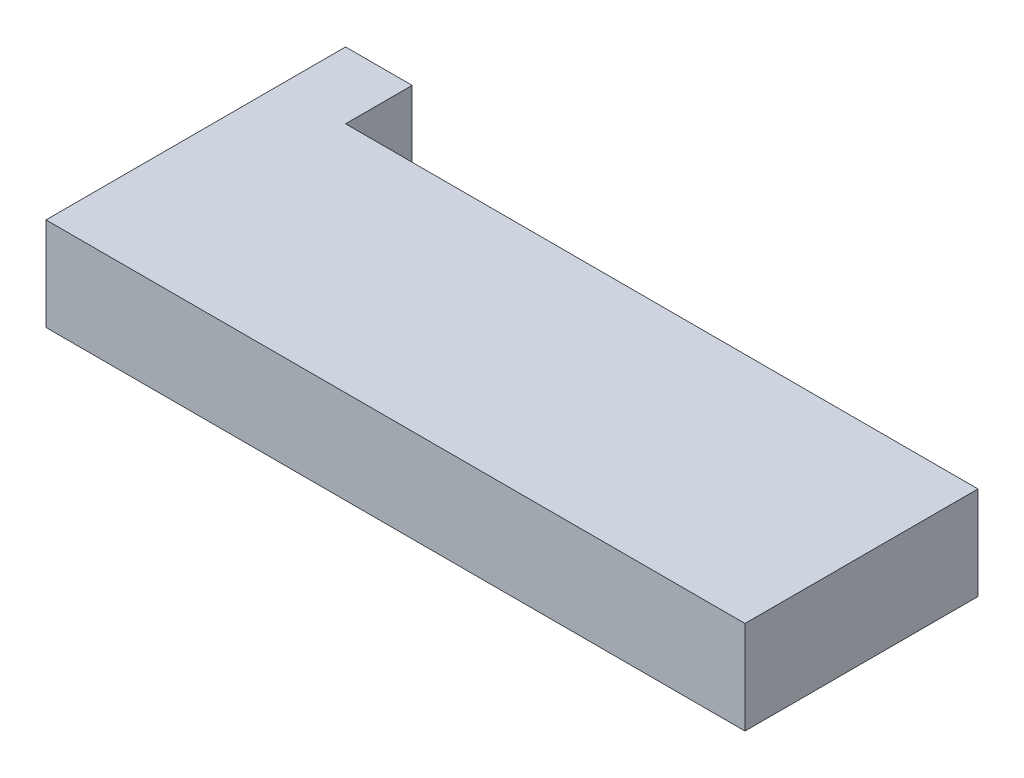
ISO-10303-21;
HEADER;
FILE_DESCRIPTION(('STEP AP214'),'2;1');
FILE_NAME('part.step','',(''),(''),'','','');
FILE_SCHEMA(('AUTOMOTIVE_DESIGN { 1 0 10303 214 1 1 1 1 }'));
ENDSEC;
DATA;
#1=APPLICATION_CONTEXT('core data for automotive mechanical design processes');
#2=APPLICATION_PROTOCOL_DEFINITION('international standard','automotive_design',2000,#1);
#3=PRODUCT_CONTEXT('',#1,'mechanical');
#4=PRODUCT('Part','Part','',(#3));
#5=PRODUCT_RELATED_PRODUCT_CATEGORY('part','',(#4));
#6=PRODUCT_DEFINITION_FORMATION('','',#4);
#7=PRODUCT_DEFINITION_CONTEXT('part definition',#1,'design');
#8=PRODUCT_DEFINITION('design','',#6,#7);
#9=PRODUCT_DEFINITION_SHAPE('','',#8);
#10=(LENGTH_UNIT() NAMED_UNIT(*) SI_UNIT(.MILLI.,.METRE.));
#11=(NAMED_UNIT(*) PLANE_ANGLE_UNIT() SI_UNIT($,.RADIAN.));
#12=(NAMED_UNIT(*) SI_UNIT($,.STERADIAN.) SOLID_ANGLE_UNIT());
#13=UNCERTAINTY_MEASURE_WITH_UNIT(LENGTH_MEASURE(1.E-05),#10,'distance_accuracy_value','');
#14=(GEOMETRIC_REPRESENTATION_CONTEXT(3) GLOBAL_UNCERTAINTY_ASSIGNED_CONTEXT((#13)) GLOBAL_UNIT_ASSIGNED_CONTEXT((#10,
#11,#12)) REPRESENTATION_CONTEXT('',''));
#15=CARTESIAN_POINT('',(0.,0.,0.));
#16=DIRECTION('',(0.,0.,1.));
#17=DIRECTION('',(1.,0.,0.));
#18=AXIS2_PLACEMENT_3D('',#15,#16,#17);
#19=CARTESIAN_POINT('',(-52.5,14.,-17.5));
#20=DIRECTION('',(0.,0.,1.));
#21=DIRECTION('',(1.,0.,0.));
#22=AXIS2_PLACEMENT_3D('',#19,#20,#21);
#23=PLANE('',#22);
#24=DIRECTION('',(0.,-1.,0.));
#25=VECTOR('',#24,1.);
#26=CARTESIAN_POINT('',(-42.5,14.,-17.5));
#27=LINE('',#26,#25);
#28=CARTESIAN_POINT('',(-42.5,14.,-17.5));
#29=VERTEX_POINT('',#28);
#30=CARTESIAN_POINT('',(-42.5,0.,-17.5));
#31=VERTEX_POINT('',#30);
#32=EDGE_CURVE('E53',#29,#31,#27,.T.);
#33=ORIENTED_EDGE('',*,*,#32,.F.);
#34=DIRECTION('',(-1.,0.,0.));
#35=VECTOR('',#34,1.);
#36=CARTESIAN_POINT('',(-52.5,14.,-17.5));
#37=LINE('',#36,#35);
#38=CARTESIAN_POINT('',(52.5,14.,-17.5));
#39=VERTEX_POINT('',#38);
#40=EDGE_CURVE('E133',#39,#29,#37,.T.);
#41=ORIENTED_EDGE('',*,*,#40,.F.);
#42=DIRECTION('',(0.,-1.,0.));
#43=VECTOR('',#42,1.);
#44=CARTESIAN_POINT('',(52.5,14.,-17.5));
#45=LINE('',#44,#43);
#46=CARTESIAN_POINT('',(52.5,0.,-17.5));
#47=VERTEX_POINT('',#46);
#48=EDGE_CURVE('E135',#39,#47,#45,.T.);
#49=ORIENTED_EDGE('',*,*,#48,.T.);
#50=DIRECTION('',(-1.,0.,0.));
#51=VECTOR('',#50,1.);
#52=CARTESIAN_POINT('',(-52.5,0.,-17.5));
#53=LINE('',#52,#51);
#54=EDGE_CURVE('E106',#47,#31,#53,.T.);
#55=ORIENTED_EDGE('',*,*,#54,.T.);
#56=EDGE_LOOP('',(#33,#41,#49,#55));
#57=FACE_BOUND('',#56,.T.);
#58=ADVANCED_FACE('F38',(#57),#23,.F.);
#59=CARTESIAN_POINT('',(-52.5,14.,-17.5));
#60=DIRECTION('',(1.,0.,0.));
#61=DIRECTION('',(0.,0.,-1.));
#62=AXIS2_PLACEMENT_3D('',#59,#60,#61);
#63=PLANE('',#62);
#64=DIRECTION('',(0.,0.,1.));
#65=VECTOR('',#64,1.);
#66=CARTESIAN_POINT('',(-52.5,0.,-17.5));
#67=LINE('',#66,#65);
#68=CARTESIAN_POINT('',(-52.5,0.,-27.5));
#69=VERTEX_POINT('',#68);
#70=CARTESIAN_POINT('',(-52.5,0.,17.5));
#71=VERTEX_POINT('',#70);
#72=EDGE_CURVE('E129',#69,#71,#67,.T.);
#73=ORIENTED_EDGE('',*,*,#72,.T.);
#74=DIRECTION('',(0.,-1.,0.));
#75=VECTOR('',#74,1.);
#76=CARTESIAN_POINT('',(-52.5,14.,17.5));
#77=LINE('',#76,#75);
#78=CARTESIAN_POINT('',(-52.5,14.,17.5));
#79=VERTEX_POINT('',#78);
#80=EDGE_CURVE('E11',#79,#71,#77,.T.);
#81=ORIENTED_EDGE('',*,*,#80,.F.);
#82=DIRECTION('',(0.,0.,1.));
#83=VECTOR('',#82,1.);
#84=CARTESIAN_POINT('',(-52.5,14.,-17.5));
#85=LINE('',#84,#83);
#86=CARTESIAN_POINT('',(-52.5,14.,-27.5));
#87=VERTEX_POINT('',#86);
#88=EDGE_CURVE('E101',#87,#79,#85,.T.);
#89=ORIENTED_EDGE('',*,*,#88,.F.);
#90=DIRECTION('',(0.,1.,0.));
#91=VECTOR('',#90,1.);
#92=CARTESIAN_POINT('',(-52.5,14.,-27.5));
#93=LINE('',#92,#91);
#94=EDGE_CURVE('E105',#69,#87,#93,.T.);
#95=ORIENTED_EDGE('',*,*,#94,.F.);
#96=EDGE_LOOP('',(#73,#81,#89,#95));
#97=FACE_BOUND('',#96,.T.);
#98=ADVANCED_FACE('F40',(#97),#63,.F.);
#99=CARTESIAN_POINT('',(-52.5,14.,17.5));
#100=DIRECTION('',(0.,0.,-1.));
#101=DIRECTION('',(-1.,0.,0.));
#102=AXIS2_PLACEMENT_3D('',#99,#100,#101);
#103=PLANE('',#102);
#104=DIRECTION('',(1.,0.,0.));
#105=VECTOR('',#104,1.);
#106=CARTESIAN_POINT('',(-52.5,0.,17.5));
#107=LINE('',#106,#105);
#108=CARTESIAN_POINT('',(52.5,0.,17.5));
#109=VERTEX_POINT('',#108);
#110=EDGE_CURVE('E137',#71,#109,#107,.T.);
#111=ORIENTED_EDGE('',*,*,#110,.T.);
#112=DIRECTION('',(0.,-1.,0.));
#113=VECTOR('',#112,1.);
#114=CARTESIAN_POINT('',(52.5,14.,17.5));
#115=LINE('',#114,#113);
#116=CARTESIAN_POINT('',(52.5,14.,17.5));
#117=VERTEX_POINT('',#116);
#118=EDGE_CURVE('E46',#117,#109,#115,.T.);
#119=ORIENTED_EDGE('',*,*,#118,.F.);
#120=DIRECTION('',(1.,0.,0.));
#121=VECTOR('',#120,1.);
#122=CARTESIAN_POINT('',(-52.5,14.,17.5));
#123=LINE('',#122,#121);
#124=EDGE_CURVE('E83',#79,#117,#123,.T.);
#125=ORIENTED_EDGE('',*,*,#124,.F.);
#126=ORIENTED_EDGE('',*,*,#80,.T.);
#127=EDGE_LOOP('',(#111,#119,#125,#126));
#128=FACE_BOUND('',#127,.T.);
#129=ADVANCED_FACE('F162',(#128),#103,.F.);
#130=CARTESIAN_POINT('',(52.5,14.,-17.5));
#131=DIRECTION('',(-1.,0.,0.));
#132=DIRECTION('',(0.,0.,1.));
#133=AXIS2_PLACEMENT_3D('',#130,#131,#132);
#134=PLANE('',#133);
#135=DIRECTION('',(0.,0.,-1.));
#136=VECTOR('',#135,1.);
#137=CARTESIAN_POINT('',(52.5,0.,-17.5));
#138=LINE('',#137,#136);
#139=EDGE_CURVE('E78',#109,#47,#138,.T.);
#140=ORIENTED_EDGE('',*,*,#139,.T.);
#141=ORIENTED_EDGE('',*,*,#48,.F.);
#142=DIRECTION('',(0.,0.,-1.));
#143=VECTOR('',#142,1.);
#144=CARTESIAN_POINT('',(52.5,14.,-17.5));
#145=LINE('',#144,#143);
#146=EDGE_CURVE('E61',#117,#39,#145,.T.);
#147=ORIENTED_EDGE('',*,*,#146,.F.);
#148=ORIENTED_EDGE('',*,*,#118,.T.);
#149=EDGE_LOOP('',(#140,#141,#147,#148));
#150=FACE_BOUND('',#149,.T.);
#151=ADVANCED_FACE('F141',(#150),#134,.F.);
#152=CARTESIAN_POINT('',(0.,14.,0.));
#153=DIRECTION('',(0.,1.,0.));
#154=DIRECTION('',(0.,0.,1.));
#155=AXIS2_PLACEMENT_3D('',#152,#153,#154);
#156=PLANE('',#155);
#157=ORIENTED_EDGE('',*,*,#88,.T.);
#158=ORIENTED_EDGE('',*,*,#124,.T.);
#159=ORIENTED_EDGE('',*,*,#146,.T.);
#160=ORIENTED_EDGE('',*,*,#40,.T.);
#161=DIRECTION('',(0.,0.,1.));
#162=VECTOR('',#161,1.);
#163=CARTESIAN_POINT('',(-42.5,14.,-27.5));
#164=LINE('',#163,#162);
#165=CARTESIAN_POINT('',(-42.5,14.,-27.5));
#166=VERTEX_POINT('',#165);
#167=EDGE_CURVE('E112',#166,#29,#164,.T.);
#168=ORIENTED_EDGE('',*,*,#167,.F.);
#169=DIRECTION('',(1.,0.,0.));
#170=VECTOR('',#169,1.);
#171=CARTESIAN_POINT('',(-52.5,14.,-27.5));
#172=LINE('',#171,#170);
#173=EDGE_CURVE('E109',#87,#166,#172,.T.);
#174=ORIENTED_EDGE('',*,*,#173,.F.);
#175=EDGE_LOOP('',(#157,#158,#159,#160,#168,#174));
#176=FACE_BOUND('',#175,.T.);
#177=ADVANCED_FACE('F110',(#176),#156,.T.);
#178=CARTESIAN_POINT('',(0.,0.,0.));
#179=DIRECTION('',(0.,1.,0.));
#180=DIRECTION('',(0.,0.,1.));
#181=AXIS2_PLACEMENT_3D('',#178,#179,#180);
#182=PLANE('',#181);
#183=ORIENTED_EDGE('',*,*,#72,.F.);
#184=DIRECTION('',(-1.,0.,0.));
#185=VECTOR('',#184,1.);
#186=CARTESIAN_POINT('',(-52.5,0.,-27.5));
#187=LINE('',#186,#185);
#188=CARTESIAN_POINT('',(-42.5,0.,-27.5));
#189=VERTEX_POINT('',#188);
#190=EDGE_CURVE('E120',#189,#69,#187,.T.);
#191=ORIENTED_EDGE('',*,*,#190,.F.);
#192=DIRECTION('',(0.,0.,1.));
#193=VECTOR('',#192,1.);
#194=CARTESIAN_POINT('',(-42.5,0.,-27.5));
#195=LINE('',#194,#193);
#196=EDGE_CURVE('E125',#189,#31,#195,.T.);
#197=ORIENTED_EDGE('',*,*,#196,.T.);
#198=ORIENTED_EDGE('',*,*,#54,.F.);
#199=ORIENTED_EDGE('',*,*,#139,.F.);
#200=ORIENTED_EDGE('',*,*,#110,.F.);
#201=EDGE_LOOP('',(#183,#191,#197,#198,#199,#200));
#202=FACE_BOUND('',#201,.T.);
#203=ADVANCED_FACE('F144',(#202),#182,.F.);
#204=CARTESIAN_POINT('',(-42.5,14.,-27.5));
#205=DIRECTION('',(-1.,0.,0.));
#206=DIRECTION('',(0.,0.,1.));
#207=AXIS2_PLACEMENT_3D('',#204,#205,#206);
#208=PLANE('',#207);
#209=ORIENTED_EDGE('',*,*,#32,.T.);
#210=ORIENTED_EDGE('',*,*,#196,.F.);
#211=DIRECTION('',(0.,-1.,0.));
#212=VECTOR('',#211,1.);
#213=CARTESIAN_POINT('',(-42.5,14.,-27.5));
#214=LINE('',#213,#212);
#215=EDGE_CURVE('E115',#166,#189,#214,.T.);
#216=ORIENTED_EDGE('',*,*,#215,.F.);
#217=ORIENTED_EDGE('',*,*,#167,.T.);
#218=EDGE_LOOP('',(#209,#210,#216,#217));
#219=FACE_BOUND('',#218,.T.);
#220=ADVANCED_FACE('F147',(#219),#208,.F.);
#221=CARTESIAN_POINT('',(0.,0.,-27.5));
#222=DIRECTION('',(0.,0.,1.));
#223=DIRECTION('',(1.,0.,0.));
#224=AXIS2_PLACEMENT_3D('',#221,#222,#223);
#225=PLANE('',#224);
#226=ORIENTED_EDGE('',*,*,#94,.T.);
#227=ORIENTED_EDGE('',*,*,#173,.T.);
#228=ORIENTED_EDGE('',*,*,#215,.T.);
#229=ORIENTED_EDGE('',*,*,#190,.T.);
#230=EDGE_LOOP('',(#226,#227,#228,#229));
#231=FACE_BOUND('',#230,.T.);
#232=ADVANCED_FACE('F118',(#231),#225,.F.);
#233=CLOSED_SHELL('',(#58,#98,#129,#151,#177,#203,#220,#232));
#234=MANIFOLD_SOLID_BREP('B2',#233);
#235=ADVANCED_BREP_SHAPE_REPRESENTATION('',(#18,#234),#14);
#236=SHAPE_DEFINITION_REPRESENTATION(#9,#235);
ENDSEC;
END-ISO-10303-21;
